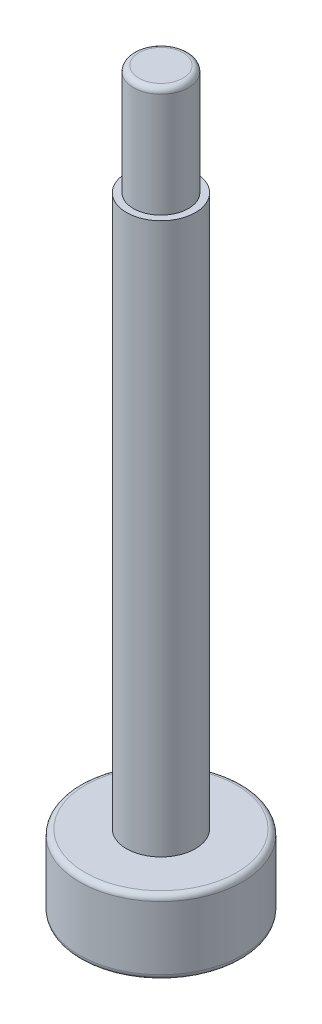
ISO-10303-21;
HEADER;
FILE_DESCRIPTION(('STEP AP214'),'2;1');
FILE_NAME('part.step','',(''),(''),'','','');
FILE_SCHEMA(('AUTOMOTIVE_DESIGN { 1 0 10303 214 1 1 1 1 }'));
ENDSEC;
DATA;
#1=APPLICATION_CONTEXT('core data for automotive mechanical design processes');
#2=APPLICATION_PROTOCOL_DEFINITION('international standard','automotive_design',2000,#1);
#3=PRODUCT_CONTEXT('',#1,'mechanical');
#4=PRODUCT('Part','Part','',(#3));
#5=PRODUCT_RELATED_PRODUCT_CATEGORY('part','',(#4));
#6=PRODUCT_DEFINITION_FORMATION('','',#4);
#7=PRODUCT_DEFINITION_CONTEXT('part definition',#1,'design');
#8=PRODUCT_DEFINITION('design','',#6,#7);
#9=PRODUCT_DEFINITION_SHAPE('','',#8);
#10=(LENGTH_UNIT() NAMED_UNIT(*) SI_UNIT(.MILLI.,.METRE.));
#11=(NAMED_UNIT(*) PLANE_ANGLE_UNIT() SI_UNIT($,.RADIAN.));
#12=(NAMED_UNIT(*) SI_UNIT($,.STERADIAN.) SOLID_ANGLE_UNIT());
#13=UNCERTAINTY_MEASURE_WITH_UNIT(LENGTH_MEASURE(1.E-05),#10,'distance_accuracy_value','');
#14=(GEOMETRIC_REPRESENTATION_CONTEXT(3) GLOBAL_UNCERTAINTY_ASSIGNED_CONTEXT((#13)) GLOBAL_UNIT_ASSIGNED_CONTEXT((#10,
#11,#12)) REPRESENTATION_CONTEXT('',''));
#15=CARTESIAN_POINT('',(0.,0.,0.));
#16=DIRECTION('',(0.,0.,1.));
#17=DIRECTION('',(1.,0.,0.));
#18=AXIS2_PLACEMENT_3D('',#15,#16,#17);
#19=CARTESIAN_POINT('',(0.,2.7,0.));
#20=DIRECTION('',(0.,-1.,0.));
#21=DIRECTION('',(0.,0.,-1.));
#22=AXIS2_PLACEMENT_3D('',#19,#20,#21);
#23=CYLINDRICAL_SURFACE('',#22,2.95);
#24=CARTESIAN_POINT('',(0.,0.2,0.));
#25=DIRECTION('',(0.,1.,0.));
#26=DIRECTION('',(0.,0.,1.));
#27=AXIS2_PLACEMENT_3D('',#24,#25,#26);
#28=CIRCLE('',#27,2.95);
#29=CARTESIAN_POINT('',(0.,0.2,2.95));
#30=VERTEX_POINT('',#29);
#31=EDGE_CURVE('E158',#30,#30,#28,.T.);
#32=ORIENTED_EDGE('',*,*,#31,.T.);
#33=EDGE_LOOP('',(#32));
#34=FACE_BOUND('',#33,.T.);
#35=CARTESIAN_POINT('',(0.,2.5,0.));
#36=DIRECTION('',(0.,1.,0.));
#37=DIRECTION('',(0.,0.,1.));
#38=AXIS2_PLACEMENT_3D('',#35,#36,#37);
#39=CIRCLE('',#38,2.95);
#40=CARTESIAN_POINT('',(0.,2.5,2.95));
#41=VERTEX_POINT('',#40);
#42=EDGE_CURVE('E150',#41,#41,#39,.F.);
#43=ORIENTED_EDGE('',*,*,#42,.T.);
#44=EDGE_LOOP('',(#43));
#45=FACE_BOUND('',#44,.T.);
#46=ADVANCED_FACE('F39',(#34,#45),#23,.T.);
#47=CARTESIAN_POINT('',(0.,2.7,0.));
#48=DIRECTION('',(0.,1.,0.));
#49=DIRECTION('',(0.,0.,1.));
#50=AXIS2_PLACEMENT_3D('',#47,#48,#49);
#51=PLANE('',#50);
#52=CARTESIAN_POINT('',(0.,2.7,0.));
#53=DIRECTION('',(0.,1.,0.));
#54=DIRECTION('',(0.,0.,1.));
#55=AXIS2_PLACEMENT_3D('',#52,#53,#54);
#56=CIRCLE('',#55,2.75);
#57=CARTESIAN_POINT('',(0.,2.7,2.75));
#58=VERTEX_POINT('',#57);
#59=EDGE_CURVE('E164',#58,#58,#56,.T.);
#60=ORIENTED_EDGE('',*,*,#59,.T.);
#61=EDGE_LOOP('',(#60));
#62=FACE_BOUND('',#61,.T.);
#63=CARTESIAN_POINT('',(0.,2.7,0.));
#64=DIRECTION('',(0.,1.,0.));
#65=DIRECTION('',(0.,0.,1.));
#66=AXIS2_PLACEMENT_3D('',#63,#64,#65);
#67=CIRCLE('',#66,1.25);
#68=CARTESIAN_POINT('',(0.,2.7,1.25));
#69=VERTEX_POINT('',#68);
#70=EDGE_CURVE('E151',#69,#69,#67,.T.);
#71=ORIENTED_EDGE('',*,*,#70,.F.);
#72=EDGE_LOOP('',(#71));
#73=FACE_BOUND('',#72,.T.);
#74=ADVANCED_FACE('F181',(#62,#73),#51,.T.);
#75=CARTESIAN_POINT('',(0.,0.,0.));
#76=DIRECTION('',(0.,1.,0.));
#77=DIRECTION('',(0.,0.,1.));
#78=AXIS2_PLACEMENT_3D('',#75,#76,#77);
#79=PLANE('',#78);
#80=CARTESIAN_POINT('',(0.,0.,0.));
#81=DIRECTION('',(0.,1.,0.));
#82=DIRECTION('',(0.,0.,1.));
#83=AXIS2_PLACEMENT_3D('',#80,#81,#82);
#84=CIRCLE('',#83,2.75);
#85=CARTESIAN_POINT('',(0.,0.,2.75));
#86=VERTEX_POINT('',#85);
#87=EDGE_CURVE('E161',#86,#86,#84,.F.);
#88=ORIENTED_EDGE('',*,*,#87,.T.);
#89=EDGE_LOOP('',(#88));
#90=FACE_BOUND('',#89,.T.);
#91=DIRECTION('',(-0.28704549437819,0.,0.95791695055322));
#92=VECTOR('',#91,1.);
#93=CARTESIAN_POINT('',(2.24728548800427,0.,-0.532016229770034));
#94=LINE('',#93,#92);
#95=CARTESIAN_POINT('',(2.24728548800427,0.,-0.532016229770034));
#96=VERTEX_POINT('',#95);
#97=CARTESIAN_POINT('',(1.58438231420861,0.,1.68019820728279));
#98=VERTEX_POINT('',#97);
#99=EDGE_CURVE('E128',#96,#98,#94,.T.);
#100=ORIENTED_EDGE('',*,*,#99,.F.);
#101=DIRECTION('',(0.686057666705715,0.,0.727547165449986));
#102=VECTOR('',#101,1.);
#103=CARTESIAN_POINT('',(0.662903173795668,0.,-2.21221443705283));
#104=LINE('',#103,#102);
#105=CARTESIAN_POINT('',(0.662903173795668,0.,-2.21221443705283));
#106=VERTEX_POINT('',#105);
#107=EDGE_CURVE('E54',#106,#96,#104,.T.);
#108=ORIENTED_EDGE('',*,*,#107,.F.);
#109=DIRECTION('',(0.973103161083906,0.,-0.230369785103234));
#110=VECTOR('',#109,1.);
#111=CARTESIAN_POINT('',(-1.58438231420861,0.,-1.68019820728279));
#112=LINE('',#111,#110);
#113=CARTESIAN_POINT('',(-1.58438231420861,0.,-1.68019820728279));
#114=VERTEX_POINT('',#113);
#115=EDGE_CURVE('E137',#114,#106,#112,.T.);
#116=ORIENTED_EDGE('',*,*,#115,.F.);
#117=DIRECTION('',(0.28704549437819,0.,-0.95791695055322));
#118=VECTOR('',#117,1.);
#119=CARTESIAN_POINT('',(-2.24728548800427,0.,0.532016229770034));
#120=LINE('',#119,#118);
#121=CARTESIAN_POINT('',(-2.24728548800427,0.,0.532016229770034));
#122=VERTEX_POINT('',#121);
#123=EDGE_CURVE('E135',#122,#114,#120,.T.);
#124=ORIENTED_EDGE('',*,*,#123,.F.);
#125=DIRECTION('',(-0.686057666705716,0.,-0.727547165449986));
#126=VECTOR('',#125,1.);
#127=CARTESIAN_POINT('',(-0.662903173795669,0.,2.21221443705283));
#128=LINE('',#127,#126);
#129=CARTESIAN_POINT('',(-0.662903173795669,0.,2.21221443705283));
#130=VERTEX_POINT('',#129);
#131=EDGE_CURVE('E102',#130,#122,#128,.T.);
#132=ORIENTED_EDGE('',*,*,#131,.F.);
#133=DIRECTION('',(-0.973103161083906,0.,0.230369785103234));
#134=VECTOR('',#133,1.);
#135=CARTESIAN_POINT('',(1.58438231420861,0.,1.68019820728279));
#136=LINE('',#135,#134);
#137=EDGE_CURVE('E131',#98,#130,#136,.T.);
#138=ORIENTED_EDGE('',*,*,#137,.F.);
#139=EDGE_LOOP('',(#100,#108,#116,#124,#132,#138));
#140=FACE_BOUND('',#139,.T.);
#141=ADVANCED_FACE('F187',(#90,#140),#79,.F.);
#142=CARTESIAN_POINT('',(0.,22.7,0.));
#143=DIRECTION('',(0.,-1.,0.));
#144=DIRECTION('',(0.,0.,-1.));
#145=AXIS2_PLACEMENT_3D('',#142,#143,#144);
#146=CYLINDRICAL_SURFACE('',#145,1.25);
#147=CARTESIAN_POINT('',(0.,22.7,0.));
#148=DIRECTION('',(0.,1.,0.));
#149=DIRECTION('',(0.,0.,1.));
#150=AXIS2_PLACEMENT_3D('',#147,#148,#149);
#151=CIRCLE('',#150,1.25);
#152=CARTESIAN_POINT('',(0.,22.7,1.25));
#153=VERTEX_POINT('',#152);
#154=EDGE_CURVE('E141',#153,#153,#151,.T.);
#155=ORIENTED_EDGE('',*,*,#154,.F.);
#156=EDGE_LOOP('',(#155));
#157=FACE_BOUND('',#156,.T.);
#158=ORIENTED_EDGE('',*,*,#70,.T.);
#159=EDGE_LOOP('',(#158));
#160=FACE_BOUND('',#159,.T.);
#161=ADVANCED_FACE('F206',(#157,#160),#146,.T.);
#162=CARTESIAN_POINT('',(0.,22.7,0.));
#163=DIRECTION('',(0.,1.,0.));
#164=DIRECTION('',(0.,0.,1.));
#165=AXIS2_PLACEMENT_3D('',#162,#163,#164);
#166=PLANE('',#165);
#167=CARTESIAN_POINT('',(0.,22.7,0.));
#168=DIRECTION('',(0.,1.,0.));
#169=DIRECTION('',(0.,0.,1.));
#170=AXIS2_PLACEMENT_3D('',#167,#168,#169);
#171=CIRCLE('',#170,1.);
#172=CARTESIAN_POINT('',(0.,22.7,1.));
#173=VERTEX_POINT('',#172);
#174=EDGE_CURVE('E147',#173,#173,#171,.T.);
#175=ORIENTED_EDGE('',*,*,#174,.F.);
#176=EDGE_LOOP('',(#175));
#177=FACE_BOUND('',#176,.T.);
#178=ORIENTED_EDGE('',*,*,#154,.T.);
#179=EDGE_LOOP('',(#178));
#180=FACE_BOUND('',#179,.T.);
#181=ADVANCED_FACE('F228',(#177,#180),#166,.T.);
#182=CARTESIAN_POINT('',(0.,26.7,0.));
#183=DIRECTION('',(0.,-1.,0.));
#184=DIRECTION('',(0.,0.,-1.));
#185=AXIS2_PLACEMENT_3D('',#182,#183,#184);
#186=CYLINDRICAL_SURFACE('',#185,1.);
#187=CARTESIAN_POINT('',(0.,26.5,0.));
#188=DIRECTION('',(0.,1.,0.));
#189=DIRECTION('',(0.,0.,1.));
#190=AXIS2_PLACEMENT_3D('',#187,#188,#189);
#191=CIRCLE('',#190,1.);
#192=CARTESIAN_POINT('',(0.,26.5,1.));
#193=VERTEX_POINT('',#192);
#194=EDGE_CURVE('E11',#193,#193,#191,.F.);
#195=ORIENTED_EDGE('',*,*,#194,.T.);
#196=EDGE_LOOP('',(#195));
#197=FACE_BOUND('',#196,.T.);
#198=ORIENTED_EDGE('',*,*,#174,.T.);
#199=EDGE_LOOP('',(#198));
#200=FACE_BOUND('',#199,.T.);
#201=ADVANCED_FACE('F221',(#197,#200),#186,.T.);
#202=CARTESIAN_POINT('',(0.,26.7,0.));
#203=DIRECTION('',(0.,1.,0.));
#204=DIRECTION('',(0.,0.,1.));
#205=AXIS2_PLACEMENT_3D('',#202,#203,#204);
#206=PLANE('',#205);
#207=CARTESIAN_POINT('',(0.,26.7,0.));
#208=DIRECTION('',(0.,1.,0.));
#209=DIRECTION('',(0.,0.,1.));
#210=AXIS2_PLACEMENT_3D('',#207,#208,#209);
#211=CIRCLE('',#210,0.8);
#212=CARTESIAN_POINT('',(0.,26.7,0.8));
#213=VERTEX_POINT('',#212);
#214=EDGE_CURVE('E47',#213,#213,#211,.T.);
#215=ORIENTED_EDGE('',*,*,#214,.T.);
#216=EDGE_LOOP('',(#215));
#217=FACE_BOUND('',#216,.T.);
#218=ADVANCED_FACE('F169',(#217),#206,.T.);
#219=CARTESIAN_POINT('',(0.662903173795668,2.,-2.21221443705283));
#220=DIRECTION('',(0.727547165449986,0.,-0.686057666705715));
#221=DIRECTION('',(-0.686057666705716,0.,-0.727547165449986));
#222=AXIS2_PLACEMENT_3D('',#219,#220,#221);
#223=PLANE('',#222);
#224=ORIENTED_EDGE('',*,*,#107,.T.);
#225=DIRECTION('',(0.,-1.,0.));
#226=VECTOR('',#225,1.);
#227=CARTESIAN_POINT('',(2.24728548800427,2.,-0.532016229770034));
#228=LINE('',#227,#226);
#229=CARTESIAN_POINT('',(2.24728548800427,2.,-0.532016229770034));
#230=VERTEX_POINT('',#229);
#231=EDGE_CURVE('E84',#230,#96,#228,.T.);
#232=ORIENTED_EDGE('',*,*,#231,.F.);
#233=DIRECTION('',(0.686057666705715,0.,0.727547165449986));
#234=VECTOR('',#233,1.);
#235=CARTESIAN_POINT('',(0.662903173795668,2.,-2.21221443705283));
#236=LINE('',#235,#234);
#237=CARTESIAN_POINT('',(0.662903173795668,2.,-2.21221443705283));
#238=VERTEX_POINT('',#237);
#239=EDGE_CURVE('E139',#238,#230,#236,.T.);
#240=ORIENTED_EDGE('',*,*,#239,.F.);
#241=DIRECTION('',(0.,-1.,0.));
#242=VECTOR('',#241,1.);
#243=CARTESIAN_POINT('',(0.662903173795668,2.,-2.21221443705283));
#244=LINE('',#243,#242);
#245=EDGE_CURVE('E62',#238,#106,#244,.T.);
#246=ORIENTED_EDGE('',*,*,#245,.T.);
#247=EDGE_LOOP('',(#224,#232,#240,#246));
#248=FACE_BOUND('',#247,.T.);
#249=ADVANCED_FACE('F212',(#248),#223,.F.);
#250=CARTESIAN_POINT('',(-1.58438231420861,2.,-1.68019820728279));
#251=DIRECTION('',(-0.230369785103234,0.,-0.973103161083906));
#252=DIRECTION('',(-0.973103161083906,0.,0.230369785103234));
#253=AXIS2_PLACEMENT_3D('',#250,#251,#252);
#254=PLANE('',#253);
#255=ORIENTED_EDGE('',*,*,#115,.T.);
#256=ORIENTED_EDGE('',*,*,#245,.F.);
#257=DIRECTION('',(0.973103161083906,0.,-0.230369785103234));
#258=VECTOR('',#257,1.);
#259=CARTESIAN_POINT('',(-1.58438231420861,2.,-1.68019820728279));
#260=LINE('',#259,#258);
#261=CARTESIAN_POINT('',(-1.58438231420861,2.,-1.68019820728279));
#262=VERTEX_POINT('',#261);
#263=EDGE_CURVE('E114',#262,#238,#260,.T.);
#264=ORIENTED_EDGE('',*,*,#263,.F.);
#265=DIRECTION('',(0.,-1.,0.));
#266=VECTOR('',#265,1.);
#267=CARTESIAN_POINT('',(-1.58438231420861,2.,-1.68019820728279));
#268=LINE('',#267,#266);
#269=EDGE_CURVE('E106',#262,#114,#268,.T.);
#270=ORIENTED_EDGE('',*,*,#269,.T.);
#271=EDGE_LOOP('',(#255,#256,#264,#270));
#272=FACE_BOUND('',#271,.T.);
#273=ADVANCED_FACE('F214',(#272),#254,.F.);
#274=CARTESIAN_POINT('',(-2.24728548800427,2.,0.532016229770034));
#275=DIRECTION('',(-0.95791695055322,0.,-0.28704549437819));
#276=DIRECTION('',(-0.28704549437819,0.,0.95791695055322));
#277=AXIS2_PLACEMENT_3D('',#274,#275,#276);
#278=PLANE('',#277);
#279=ORIENTED_EDGE('',*,*,#123,.T.);
#280=ORIENTED_EDGE('',*,*,#269,.F.);
#281=DIRECTION('',(0.28704549437819,0.,-0.95791695055322));
#282=VECTOR('',#281,1.);
#283=CARTESIAN_POINT('',(-2.24728548800427,2.,0.532016229770034));
#284=LINE('',#283,#282);
#285=CARTESIAN_POINT('',(-2.24728548800427,2.,0.532016229770034));
#286=VERTEX_POINT('',#285);
#287=EDGE_CURVE('E110',#286,#262,#284,.T.);
#288=ORIENTED_EDGE('',*,*,#287,.F.);
#289=DIRECTION('',(0.,-1.,0.));
#290=VECTOR('',#289,1.);
#291=CARTESIAN_POINT('',(-2.24728548800427,2.,0.532016229770034));
#292=LINE('',#291,#290);
#293=EDGE_CURVE('E95',#286,#122,#292,.T.);
#294=ORIENTED_EDGE('',*,*,#293,.T.);
#295=EDGE_LOOP('',(#279,#280,#288,#294));
#296=FACE_BOUND('',#295,.T.);
#297=ADVANCED_FACE('F111',(#296),#278,.F.);
#298=CARTESIAN_POINT('',(-0.662903173795669,2.,2.21221443705283));
#299=DIRECTION('',(-0.727547165449986,0.,0.686057666705716));
#300=DIRECTION('',(0.686057666705716,0.,0.727547165449986));
#301=AXIS2_PLACEMENT_3D('',#298,#299,#300);
#302=PLANE('',#301);
#303=ORIENTED_EDGE('',*,*,#131,.T.);
#304=ORIENTED_EDGE('',*,*,#293,.F.);
#305=DIRECTION('',(-0.686057666705716,0.,-0.727547165449986));
#306=VECTOR('',#305,1.);
#307=CARTESIAN_POINT('',(-0.662903173795669,2.,2.21221443705283));
#308=LINE('',#307,#306);
#309=CARTESIAN_POINT('',(-0.662903173795669,2.,2.21221443705283));
#310=VERTEX_POINT('',#309);
#311=EDGE_CURVE('E99',#310,#286,#308,.T.);
#312=ORIENTED_EDGE('',*,*,#311,.F.);
#313=DIRECTION('',(0.,-1.,0.));
#314=VECTOR('',#313,1.);
#315=CARTESIAN_POINT('',(-0.662903173795669,2.,2.21221443705283));
#316=LINE('',#315,#314);
#317=EDGE_CURVE('E107',#310,#130,#316,.T.);
#318=ORIENTED_EDGE('',*,*,#317,.T.);
#319=EDGE_LOOP('',(#303,#304,#312,#318));
#320=FACE_BOUND('',#319,.T.);
#321=ADVANCED_FACE('F97',(#320),#302,.F.);
#322=CARTESIAN_POINT('',(1.58438231420861,2.,1.68019820728279));
#323=DIRECTION('',(0.230369785103234,0.,0.973103161083906));
#324=DIRECTION('',(0.973103161083906,0.,-0.230369785103234));
#325=AXIS2_PLACEMENT_3D('',#322,#323,#324);
#326=PLANE('',#325);
#327=ORIENTED_EDGE('',*,*,#137,.T.);
#328=ORIENTED_EDGE('',*,*,#317,.F.);
#329=DIRECTION('',(-0.973103161083906,0.,0.230369785103234));
#330=VECTOR('',#329,1.);
#331=CARTESIAN_POINT('',(1.58438231420861,2.,1.68019820728279));
#332=LINE('',#331,#330);
#333=CARTESIAN_POINT('',(1.58438231420861,2.,1.68019820728279));
#334=VERTEX_POINT('',#333);
#335=EDGE_CURVE('E120',#334,#310,#332,.T.);
#336=ORIENTED_EDGE('',*,*,#335,.F.);
#337=DIRECTION('',(0.,-1.,0.));
#338=VECTOR('',#337,1.);
#339=CARTESIAN_POINT('',(1.58438231420861,2.,1.68019820728279));
#340=LINE('',#339,#338);
#341=EDGE_CURVE('E144',#334,#98,#340,.T.);
#342=ORIENTED_EDGE('',*,*,#341,.T.);
#343=EDGE_LOOP('',(#327,#328,#336,#342));
#344=FACE_BOUND('',#343,.T.);
#345=ADVANCED_FACE('F286',(#344),#326,.F.);
#346=CARTESIAN_POINT('',(2.24728548800427,2.,-0.532016229770034));
#347=DIRECTION('',(0.95791695055322,0.,0.28704549437819));
#348=DIRECTION('',(0.28704549437819,0.,-0.95791695055322));
#349=AXIS2_PLACEMENT_3D('',#346,#347,#348);
#350=PLANE('',#349);
#351=ORIENTED_EDGE('',*,*,#99,.T.);
#352=ORIENTED_EDGE('',*,*,#341,.F.);
#353=DIRECTION('',(-0.28704549437819,0.,0.95791695055322));
#354=VECTOR('',#353,1.);
#355=CARTESIAN_POINT('',(2.24728548800427,2.,-0.532016229770034));
#356=LINE('',#355,#354);
#357=EDGE_CURVE('E122',#230,#334,#356,.T.);
#358=ORIENTED_EDGE('',*,*,#357,.F.);
#359=ORIENTED_EDGE('',*,*,#231,.T.);
#360=EDGE_LOOP('',(#351,#352,#358,#359));
#361=FACE_BOUND('',#360,.T.);
#362=ADVANCED_FACE('F198',(#361),#350,.F.);
#363=CARTESIAN_POINT('',(0.,2.,0.));
#364=DIRECTION('',(0.,-1.,0.));
#365=DIRECTION('',(0.,0.,-1.));
#366=AXIS2_PLACEMENT_3D('',#363,#364,#365);
#367=PLANE('',#366);
#368=ORIENTED_EDGE('',*,*,#239,.T.);
#369=ORIENTED_EDGE('',*,*,#357,.T.);
#370=ORIENTED_EDGE('',*,*,#335,.T.);
#371=ORIENTED_EDGE('',*,*,#311,.T.);
#372=ORIENTED_EDGE('',*,*,#287,.T.);
#373=ORIENTED_EDGE('',*,*,#263,.T.);
#374=EDGE_LOOP('',(#368,#369,#370,#371,#372,#373));
#375=FACE_BOUND('',#374,.T.);
#376=ADVANCED_FACE('F117',(#375),#367,.T.);
#377=CARTESIAN_POINT('',(0.,0.2,0.));
#378=DIRECTION('',(0.,1.,0.));
#379=DIRECTION('',(0.,0.,1.));
#380=AXIS2_PLACEMENT_3D('',#377,#378,#379);
#381=TOROIDAL_SURFACE('',#380,2.75,0.2);
#382=ORIENTED_EDGE('',*,*,#87,.F.);
#383=EDGE_LOOP('',(#382));
#384=FACE_BOUND('',#383,.T.);
#385=ORIENTED_EDGE('',*,*,#31,.F.);
#386=EDGE_LOOP('',(#385));
#387=FACE_BOUND('',#386,.T.);
#388=ADVANCED_FACE('F177',(#384,#387),#381,.T.);
#389=CARTESIAN_POINT('',(0.,2.5,0.));
#390=DIRECTION('',(0.,1.,0.));
#391=DIRECTION('',(0.,0.,1.));
#392=AXIS2_PLACEMENT_3D('',#389,#390,#391);
#393=TOROIDAL_SURFACE('',#392,2.75,0.2);
#394=ORIENTED_EDGE('',*,*,#42,.F.);
#395=EDGE_LOOP('',(#394));
#396=FACE_BOUND('',#395,.T.);
#397=ORIENTED_EDGE('',*,*,#59,.F.);
#398=EDGE_LOOP('',(#397));
#399=FACE_BOUND('',#398,.T.);
#400=ADVANCED_FACE('F172',(#396,#399),#393,.T.);
#401=CARTESIAN_POINT('',(0.,26.5,0.));
#402=DIRECTION('',(0.,1.,0.));
#403=DIRECTION('',(0.,0.,1.));
#404=AXIS2_PLACEMENT_3D('',#401,#402,#403);
#405=TOROIDAL_SURFACE('',#404,0.8,0.2);
#406=ORIENTED_EDGE('',*,*,#194,.F.);
#407=EDGE_LOOP('',(#406));
#408=FACE_BOUND('',#407,.T.);
#409=ORIENTED_EDGE('',*,*,#214,.F.);
#410=EDGE_LOOP('',(#409));
#411=FACE_BOUND('',#410,.T.);
#412=ADVANCED_FACE('F41',(#408,#411),#405,.T.);
#413=CLOSED_SHELL('',(#46,#74,#141,#161,#181,#201,#218,#249,#273,#297,#321,#345,#362,#376,#388,
#400,#412));
#414=MANIFOLD_SOLID_BREP('B2',#413);
#415=ADVANCED_BREP_SHAPE_REPRESENTATION('',(#18,#414),#14);
#416=SHAPE_DEFINITION_REPRESENTATION(#9,#415);
ENDSEC;
END-ISO-10303-21;
